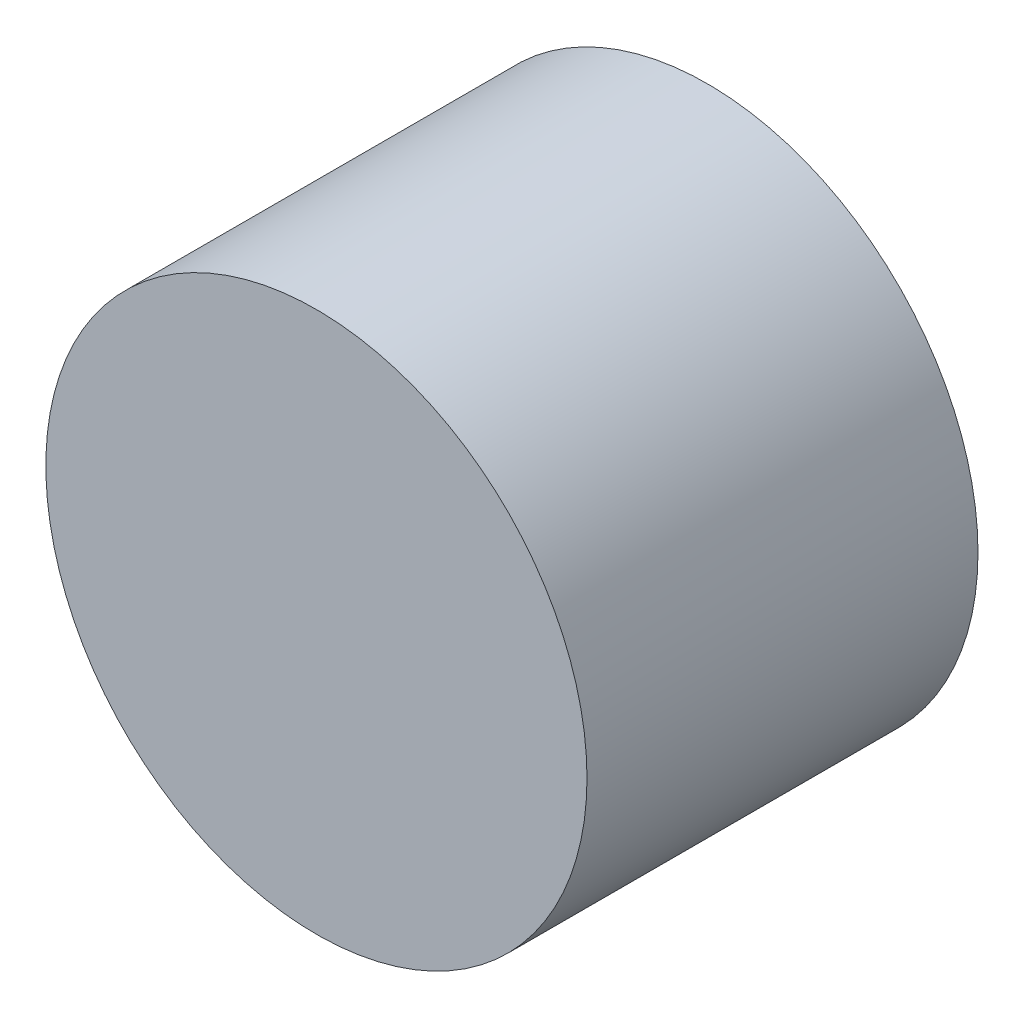
ISO-10303-21;
HEADER;
FILE_DESCRIPTION(('STEP AP214'),'2;1');
FILE_NAME('part.step','',(''),(''),'','','');
FILE_SCHEMA(('AUTOMOTIVE_DESIGN { 1 0 10303 214 1 1 1 1 }'));
ENDSEC;
DATA;
#1=APPLICATION_CONTEXT('core data for automotive mechanical design processes');
#2=APPLICATION_PROTOCOL_DEFINITION('international standard','automotive_design',2000,#1);
#3=PRODUCT_CONTEXT('',#1,'mechanical');
#4=PRODUCT('Part','Part','',(#3));
#5=PRODUCT_RELATED_PRODUCT_CATEGORY('part','',(#4));
#6=PRODUCT_DEFINITION_FORMATION('','',#4);
#7=PRODUCT_DEFINITION_CONTEXT('part definition',#1,'design');
#8=PRODUCT_DEFINITION('design','',#6,#7);
#9=PRODUCT_DEFINITION_SHAPE('','',#8);
#10=(LENGTH_UNIT() NAMED_UNIT(*) SI_UNIT(.MILLI.,.METRE.));
#11=(NAMED_UNIT(*) PLANE_ANGLE_UNIT() SI_UNIT($,.RADIAN.));
#12=(NAMED_UNIT(*) SI_UNIT($,.STERADIAN.) SOLID_ANGLE_UNIT());
#13=UNCERTAINTY_MEASURE_WITH_UNIT(LENGTH_MEASURE(1.E-05),#10,'distance_accuracy_value','');
#14=(GEOMETRIC_REPRESENTATION_CONTEXT(3) GLOBAL_UNCERTAINTY_ASSIGNED_CONTEXT((#13)) GLOBAL_UNIT_ASSIGNED_CONTEXT((#10,
#11,#12)) REPRESENTATION_CONTEXT('',''));
#15=CARTESIAN_POINT('',(0.,0.,0.));
#16=DIRECTION('',(0.,0.,1.));
#17=DIRECTION('',(1.,0.,0.));
#18=AXIS2_PLACEMENT_3D('',#15,#16,#17);
#19=CARTESIAN_POINT('',(0.,0.,28.9));
#20=DIRECTION('',(0.,0.,-1.));
#21=DIRECTION('',(-1.,0.,0.));
#22=AXIS2_PLACEMENT_3D('',#19,#20,#21);
#23=CYLINDRICAL_SURFACE('',#22,20.);
#24=CARTESIAN_POINT('',(0.,0.,28.9));
#25=DIRECTION('',(0.,0.,-1.));
#26=DIRECTION('',(1.,0.,0.));
#27=AXIS2_PLACEMENT_3D('',#24,#25,#26);
#28=CIRCLE('',#27,20.);
#29=CARTESIAN_POINT('',(20.,0.,28.9));
#30=VERTEX_POINT('',#29);
#31=EDGE_CURVE('E10',#30,#30,#28,.T.);
#32=ORIENTED_EDGE('',*,*,#31,.T.);
#33=EDGE_LOOP('',(#32));
#34=FACE_BOUND('',#33,.T.);
#35=CARTESIAN_POINT('',(0.,0.,0.));
#36=DIRECTION('',(0.,0.,-1.));
#37=DIRECTION('',(1.,0.,0.));
#38=AXIS2_PLACEMENT_3D('',#35,#36,#37);
#39=CIRCLE('',#38,20.);
#40=CARTESIAN_POINT('',(20.,0.,0.));
#41=VERTEX_POINT('',#40);
#42=EDGE_CURVE('E18',#41,#41,#39,.T.);
#43=ORIENTED_EDGE('',*,*,#42,.F.);
#44=EDGE_LOOP('',(#43));
#45=FACE_BOUND('',#44,.T.);
#46=ADVANCED_FACE('F15',(#34,#45),#23,.T.);
#47=CARTESIAN_POINT('',(0.,0.,28.9));
#48=DIRECTION('',(0.,0.,-1.));
#49=DIRECTION('',(-1.,0.,0.));
#50=AXIS2_PLACEMENT_3D('',#47,#48,#49);
#51=PLANE('',#50);
#52=ORIENTED_EDGE('',*,*,#31,.F.);
#53=EDGE_LOOP('',(#52));
#54=FACE_BOUND('',#53,.T.);
#55=ADVANCED_FACE('F33',(#54),#51,.F.);
#56=CARTESIAN_POINT('',(0.,0.,0.));
#57=DIRECTION('',(0.,0.,-1.));
#58=DIRECTION('',(-1.,0.,0.));
#59=AXIS2_PLACEMENT_3D('',#56,#57,#58);
#60=PLANE('',#59);
#61=ORIENTED_EDGE('',*,*,#42,.T.);
#62=EDGE_LOOP('',(#61));
#63=FACE_BOUND('',#62,.T.);
#64=ADVANCED_FACE('F30',(#63),#60,.T.);
#65=CLOSED_SHELL('',(#46,#55,#64));
#66=MANIFOLD_SOLID_BREP('B1',#65);
#67=ADVANCED_BREP_SHAPE_REPRESENTATION('',(#18,#66),#14);
#68=SHAPE_DEFINITION_REPRESENTATION(#9,#67);
ENDSEC;
END-ISO-10303-21;
